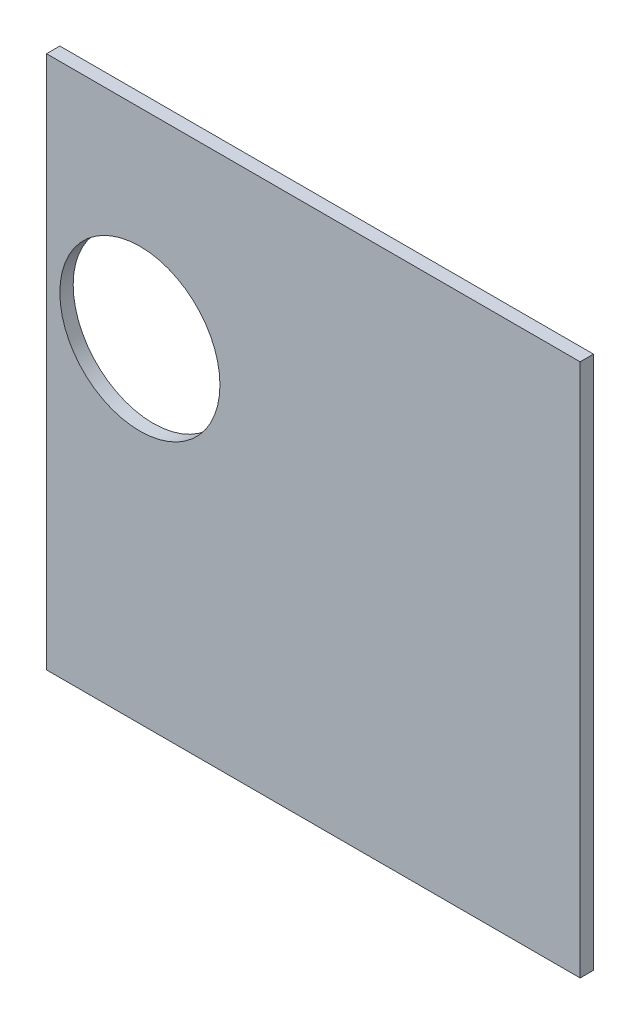
ISO-10303-21;
HEADER;
FILE_DESCRIPTION(('STEP AP214'),'2;1');
FILE_NAME('part.step','',(''),(''),'','','');
FILE_SCHEMA(('AUTOMOTIVE_DESIGN { 1 0 10303 214 1 1 1 1 }'));
ENDSEC;
DATA;
#1=APPLICATION_CONTEXT('core data for automotive mechanical design processes');
#2=APPLICATION_PROTOCOL_DEFINITION('international standard','automotive_design',2000,#1);
#3=PRODUCT_CONTEXT('',#1,'mechanical');
#4=PRODUCT('Part','Part','',(#3));
#5=PRODUCT_RELATED_PRODUCT_CATEGORY('part','',(#4));
#6=PRODUCT_DEFINITION_FORMATION('','',#4);
#7=PRODUCT_DEFINITION_CONTEXT('part definition',#1,'design');
#8=PRODUCT_DEFINITION('design','',#6,#7);
#9=PRODUCT_DEFINITION_SHAPE('','',#8);
#10=(LENGTH_UNIT() NAMED_UNIT(*) SI_UNIT(.MILLI.,.METRE.));
#11=(NAMED_UNIT(*) PLANE_ANGLE_UNIT() SI_UNIT($,.RADIAN.));
#12=(NAMED_UNIT(*) SI_UNIT($,.STERADIAN.) SOLID_ANGLE_UNIT());
#13=UNCERTAINTY_MEASURE_WITH_UNIT(LENGTH_MEASURE(1.E-05),#10,'distance_accuracy_value','');
#14=(GEOMETRIC_REPRESENTATION_CONTEXT(3) GLOBAL_UNCERTAINTY_ASSIGNED_CONTEXT((#13)) GLOBAL_UNIT_ASSIGNED_CONTEXT((#10,
#11,#12)) REPRESENTATION_CONTEXT('',''));
#15=CARTESIAN_POINT('',(0.,0.,0.));
#16=DIRECTION('',(0.,0.,1.));
#17=DIRECTION('',(1.,0.,0.));
#18=AXIS2_PLACEMENT_3D('',#15,#16,#17);
#19=CARTESIAN_POINT('',(0.,0.,6.35));
#20=DIRECTION('',(-1.,0.,0.));
#21=DIRECTION('',(0.,0.,1.));
#22=AXIS2_PLACEMENT_3D('',#19,#20,#21);
#23=PLANE('',#22);
#24=DIRECTION('',(0.,1.,0.));
#25=VECTOR('',#24,1.);
#26=CARTESIAN_POINT('',(0.,0.,0.));
#27=LINE('',#26,#25);
#28=CARTESIAN_POINT('',(0.,0.,0.));
#29=VERTEX_POINT('',#28);
#30=CARTESIAN_POINT('',(0.,254.,0.));
#31=VERTEX_POINT('',#30);
#32=EDGE_CURVE('E99',#29,#31,#27,.T.);
#33=ORIENTED_EDGE('',*,*,#32,.F.);
#34=DIRECTION('',(0.,0.,-1.));
#35=VECTOR('',#34,1.);
#36=CARTESIAN_POINT('',(0.,0.,6.35));
#37=LINE('',#36,#35);
#38=CARTESIAN_POINT('',(0.,0.,6.35));
#39=VERTEX_POINT('',#38);
#40=EDGE_CURVE('E11',#39,#29,#37,.T.);
#41=ORIENTED_EDGE('',*,*,#40,.F.);
#42=DIRECTION('',(0.,1.,0.));
#43=VECTOR('',#42,1.);
#44=CARTESIAN_POINT('',(0.,0.,6.35));
#45=LINE('',#44,#43);
#46=CARTESIAN_POINT('',(0.,254.,6.35));
#47=VERTEX_POINT('',#46);
#48=EDGE_CURVE('E93',#39,#47,#45,.T.);
#49=ORIENTED_EDGE('',*,*,#48,.T.);
#50=DIRECTION('',(0.,0.,-1.));
#51=VECTOR('',#50,1.);
#52=CARTESIAN_POINT('',(0.,254.,6.35));
#53=LINE('',#52,#51);
#54=EDGE_CURVE('E36',#47,#31,#53,.T.);
#55=ORIENTED_EDGE('',*,*,#54,.T.);
#56=EDGE_LOOP('',(#33,#41,#49,#55));
#57=FACE_BOUND('',#56,.T.);
#58=ADVANCED_FACE('F33',(#57),#23,.T.);
#59=CARTESIAN_POINT('',(0.,0.,6.35));
#60=DIRECTION('',(0.,1.,0.));
#61=DIRECTION('',(0.,0.,1.));
#62=AXIS2_PLACEMENT_3D('',#59,#60,#61);
#63=PLANE('',#62);
#64=DIRECTION('',(1.,0.,0.));
#65=VECTOR('',#64,1.);
#66=CARTESIAN_POINT('',(0.,0.,0.));
#67=LINE('',#66,#65);
#68=CARTESIAN_POINT('',(254.,0.,0.));
#69=VERTEX_POINT('',#68);
#70=EDGE_CURVE('E66',#29,#69,#67,.T.);
#71=ORIENTED_EDGE('',*,*,#70,.T.);
#72=DIRECTION('',(0.,0.,-1.));
#73=VECTOR('',#72,1.);
#74=CARTESIAN_POINT('',(254.,0.,6.35));
#75=LINE('',#74,#73);
#76=CARTESIAN_POINT('',(254.,0.,6.35));
#77=VERTEX_POINT('',#76);
#78=EDGE_CURVE('E42',#77,#69,#75,.T.);
#79=ORIENTED_EDGE('',*,*,#78,.F.);
#80=DIRECTION('',(1.,0.,0.));
#81=VECTOR('',#80,1.);
#82=CARTESIAN_POINT('',(0.,0.,6.35));
#83=LINE('',#82,#81);
#84=EDGE_CURVE('E83',#39,#77,#83,.T.);
#85=ORIENTED_EDGE('',*,*,#84,.F.);
#86=ORIENTED_EDGE('',*,*,#40,.T.);
#87=EDGE_LOOP('',(#71,#79,#85,#86));
#88=FACE_BOUND('',#87,.T.);
#89=ADVANCED_FACE('F110',(#88),#63,.F.);
#90=CARTESIAN_POINT('',(254.,0.,6.35));
#91=DIRECTION('',(-1.,0.,0.));
#92=DIRECTION('',(0.,0.,1.));
#93=AXIS2_PLACEMENT_3D('',#90,#91,#92);
#94=PLANE('',#93);
#95=DIRECTION('',(0.,1.,0.));
#96=VECTOR('',#95,1.);
#97=CARTESIAN_POINT('',(254.,0.,0.));
#98=LINE('',#97,#96);
#99=CARTESIAN_POINT('',(254.,254.,0.));
#100=VERTEX_POINT('',#99);
#101=EDGE_CURVE('E90',#69,#100,#98,.T.);
#102=ORIENTED_EDGE('',*,*,#101,.T.);
#103=DIRECTION('',(0.,0.,-1.));
#104=VECTOR('',#103,1.);
#105=CARTESIAN_POINT('',(254.,254.,6.35));
#106=LINE('',#105,#104);
#107=CARTESIAN_POINT('',(254.,254.,6.35));
#108=VERTEX_POINT('',#107);
#109=EDGE_CURVE('E87',#108,#100,#106,.T.);
#110=ORIENTED_EDGE('',*,*,#109,.F.);
#111=DIRECTION('',(0.,1.,0.));
#112=VECTOR('',#111,1.);
#113=CARTESIAN_POINT('',(254.,0.,6.35));
#114=LINE('',#113,#112);
#115=EDGE_CURVE('E78',#77,#108,#114,.T.);
#116=ORIENTED_EDGE('',*,*,#115,.F.);
#117=ORIENTED_EDGE('',*,*,#78,.T.);
#118=EDGE_LOOP('',(#102,#110,#116,#117));
#119=FACE_BOUND('',#118,.T.);
#120=ADVANCED_FACE('F88',(#119),#94,.F.);
#121=CARTESIAN_POINT('',(0.,254.,6.35));
#122=DIRECTION('',(0.,1.,0.));
#123=DIRECTION('',(0.,0.,1.));
#124=AXIS2_PLACEMENT_3D('',#121,#122,#123);
#125=PLANE('',#124);
#126=DIRECTION('',(1.,0.,0.));
#127=VECTOR('',#126,1.);
#128=CARTESIAN_POINT('',(0.,254.,0.));
#129=LINE('',#128,#127);
#130=EDGE_CURVE('E102',#31,#100,#129,.T.);
#131=ORIENTED_EDGE('',*,*,#130,.F.);
#132=ORIENTED_EDGE('',*,*,#54,.F.);
#133=DIRECTION('',(1.,0.,0.));
#134=VECTOR('',#133,1.);
#135=CARTESIAN_POINT('',(0.,254.,6.35));
#136=LINE('',#135,#134);
#137=EDGE_CURVE('E82',#47,#108,#136,.T.);
#138=ORIENTED_EDGE('',*,*,#137,.T.);
#139=ORIENTED_EDGE('',*,*,#109,.T.);
#140=EDGE_LOOP('',(#131,#132,#138,#139));
#141=FACE_BOUND('',#140,.T.);
#142=ADVANCED_FACE('F92',(#141),#125,.T.);
#143=CARTESIAN_POINT('',(0.,0.,6.35));
#144=DIRECTION('',(0.,0.,-1.));
#145=DIRECTION('',(-1.,0.,0.));
#146=AXIS2_PLACEMENT_3D('',#143,#144,#145);
#147=PLANE('',#146);
#148=CARTESIAN_POINT('',(44.45,158.75,6.35));
#149=DIRECTION('',(0.,0.,1.));
#150=DIRECTION('',(1.,0.,0.));
#151=AXIS2_PLACEMENT_3D('',#148,#149,#150);
#152=CIRCLE('',#151,38.1);
#153=CARTESIAN_POINT('',(82.55,158.75,6.35));
#154=VERTEX_POINT('',#153);
#155=EDGE_CURVE('E142',#154,#154,#152,.T.);
#156=ORIENTED_EDGE('',*,*,#155,.F.);
#157=EDGE_LOOP('',(#156));
#158=FACE_BOUND('',#157,.T.);
#159=ORIENTED_EDGE('',*,*,#48,.F.);
#160=ORIENTED_EDGE('',*,*,#84,.T.);
#161=ORIENTED_EDGE('',*,*,#115,.T.);
#162=ORIENTED_EDGE('',*,*,#137,.F.);
#163=EDGE_LOOP('',(#159,#160,#161,#162));
#164=FACE_BOUND('',#163,.T.);
#165=ADVANCED_FACE('F81',(#158,#164),#147,.F.);
#166=CARTESIAN_POINT('',(0.,0.,0.));
#167=DIRECTION('',(0.,0.,-1.));
#168=DIRECTION('',(-1.,0.,0.));
#169=AXIS2_PLACEMENT_3D('',#166,#167,#168);
#170=PLANE('',#169);
#171=CARTESIAN_POINT('',(44.45,158.75,0.));
#172=DIRECTION('',(0.,0.,1.));
#173=DIRECTION('',(1.,0.,0.));
#174=AXIS2_PLACEMENT_3D('',#171,#172,#173);
#175=CIRCLE('',#174,38.1);
#176=CARTESIAN_POINT('',(82.55,158.75,0.));
#177=VERTEX_POINT('',#176);
#178=EDGE_CURVE('E103',#177,#177,#175,.T.);
#179=ORIENTED_EDGE('',*,*,#178,.T.);
#180=EDGE_LOOP('',(#179));
#181=FACE_BOUND('',#180,.T.);
#182=ORIENTED_EDGE('',*,*,#32,.T.);
#183=ORIENTED_EDGE('',*,*,#130,.T.);
#184=ORIENTED_EDGE('',*,*,#101,.F.);
#185=ORIENTED_EDGE('',*,*,#70,.F.);
#186=EDGE_LOOP('',(#182,#183,#184,#185));
#187=FACE_BOUND('',#186,.T.);
#188=ADVANCED_FACE('F108',(#181,#187),#170,.T.);
#189=CARTESIAN_POINT('',(44.45,158.75,0.));
#190=DIRECTION('',(0.,0.,1.));
#191=DIRECTION('',(1.,0.,0.));
#192=AXIS2_PLACEMENT_3D('',#189,#190,#191);
#193=CYLINDRICAL_SURFACE('',#192,38.1);
#194=ORIENTED_EDGE('',*,*,#178,.F.);
#195=EDGE_LOOP('',(#194));
#196=FACE_BOUND('',#195,.T.);
#197=ORIENTED_EDGE('',*,*,#155,.T.);
#198=EDGE_LOOP('',(#197));
#199=FACE_BOUND('',#198,.T.);
#200=ADVANCED_FACE('F129',(#196,#199),#193,.F.);
#201=CLOSED_SHELL('',(#58,#89,#120,#142,#165,#188,#200));
#202=MANIFOLD_SOLID_BREP('B2',#201);
#203=ADVANCED_BREP_SHAPE_REPRESENTATION('',(#18,#202),#14);
#204=SHAPE_DEFINITION_REPRESENTATION(#9,#203);
ENDSEC;
END-ISO-10303-21;
